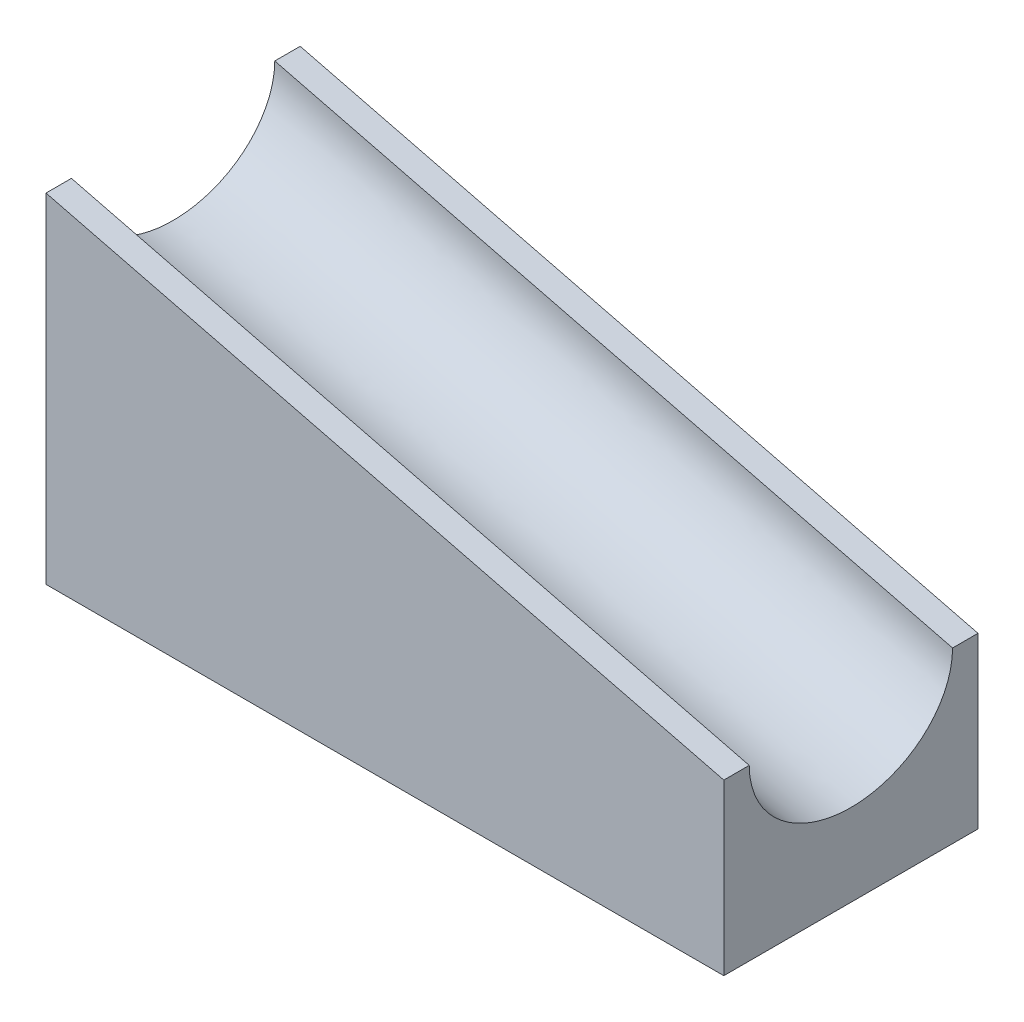
ISO-10303-21;
HEADER;
FILE_DESCRIPTION(('STEP AP214'),'2;1');
FILE_NAME('part.step','',(''),(''),'','','');
FILE_SCHEMA(('AUTOMOTIVE_DESIGN { 1 0 10303 214 1 1 1 1 }'));
ENDSEC;
DATA;
#1=APPLICATION_CONTEXT('core data for automotive mechanical design processes');
#2=APPLICATION_PROTOCOL_DEFINITION('international standard','automotive_design',2000,#1);
#3=PRODUCT_CONTEXT('',#1,'mechanical');
#4=PRODUCT('Part','Part','',(#3));
#5=PRODUCT_RELATED_PRODUCT_CATEGORY('part','',(#4));
#6=PRODUCT_DEFINITION_FORMATION('','',#4);
#7=PRODUCT_DEFINITION_CONTEXT('part definition',#1,'design');
#8=PRODUCT_DEFINITION('design','',#6,#7);
#9=PRODUCT_DEFINITION_SHAPE('','',#8);
#10=(LENGTH_UNIT() NAMED_UNIT(*) SI_UNIT(.MILLI.,.METRE.));
#11=(NAMED_UNIT(*) PLANE_ANGLE_UNIT() SI_UNIT($,.RADIAN.));
#12=(NAMED_UNIT(*) SI_UNIT($,.STERADIAN.) SOLID_ANGLE_UNIT());
#13=UNCERTAINTY_MEASURE_WITH_UNIT(LENGTH_MEASURE(1.E-05),#10,'distance_accuracy_value','');
#14=(GEOMETRIC_REPRESENTATION_CONTEXT(3) GLOBAL_UNCERTAINTY_ASSIGNED_CONTEXT((#13)) GLOBAL_UNIT_ASSIGNED_CONTEXT((#10,
#11,#12)) REPRESENTATION_CONTEXT('',''));
#15=CARTESIAN_POINT('',(0.,0.,0.));
#16=DIRECTION('',(0.,0.,1.));
#17=DIRECTION('',(1.,0.,0.));
#18=AXIS2_PLACEMENT_3D('',#15,#16,#17);
#19=CARTESIAN_POINT('',(25.4,0.,19.05));
#20=DIRECTION('',(-0.242535625036333,-0.970142500145332,0.));
#21=DIRECTION('',(0.970142500145332,-0.242535625036333,0.));
#22=AXIS2_PLACEMENT_3D('',#19,#20,#21);
#23=PLANE('',#22);
#24=DIRECTION('',(0.,0.,-1.));
#25=VECTOR('',#24,1.);
#26=CARTESIAN_POINT('',(25.4,0.,19.05));
#27=LINE('',#26,#25);
#28=CARTESIAN_POINT('',(25.4,0.,19.05));
#29=VERTEX_POINT('',#28);
#30=CARTESIAN_POINT('',(25.4,0.,17.145));
#31=VERTEX_POINT('',#30);
#32=EDGE_CURVE('E132',#29,#31,#27,.T.);
#33=ORIENTED_EDGE('',*,*,#32,.T.);
#34=DIRECTION('',(-0.970142500145332,0.242535625036333,0.));
#35=VECTOR('',#34,1.);
#36=CARTESIAN_POINT('',(28.3882352941176,-0.747058823529411,17.145));
#37=LINE('',#36,#35);
#38=CARTESIAN_POINT('',(-25.4,12.7,17.145));
#39=VERTEX_POINT('',#38);
#40=EDGE_CURVE('E61',#31,#39,#37,.T.);
#41=ORIENTED_EDGE('',*,*,#40,.T.);
#42=DIRECTION('',(0.,0.,-1.));
#43=VECTOR('',#42,1.);
#44=CARTESIAN_POINT('',(-25.4,12.7,19.05));
#45=LINE('',#44,#43);
#46=CARTESIAN_POINT('',(-25.4,12.7,19.05));
#47=VERTEX_POINT('',#46);
#48=EDGE_CURVE('E54',#47,#39,#45,.T.);
#49=ORIENTED_EDGE('',*,*,#48,.F.);
#50=DIRECTION('',(-0.970142500145332,0.242535625036333,0.));
#51=VECTOR('',#50,1.);
#52=CARTESIAN_POINT('',(25.4,0.,19.05));
#53=LINE('',#52,#51);
#54=EDGE_CURVE('E139',#29,#47,#53,.T.);
#55=ORIENTED_EDGE('',*,*,#54,.F.);
#56=EDGE_LOOP('',(#33,#41,#49,#55));
#57=FACE_BOUND('',#56,.T.);
#58=ADVANCED_FACE('F39',(#57),#23,.F.);
#59=CARTESIAN_POINT('',(-25.4,12.7,1.905));
#60=VERTEX_POINT('',#59);
#61=CARTESIAN_POINT('',(-25.4,12.7,0.));
#62=VERTEX_POINT('',#61);
#63=EDGE_CURVE('E114',#60,#62,#45,.T.);
#64=ORIENTED_EDGE('',*,*,#63,.F.);
#65=DIRECTION('',(-0.970142500145332,0.242535625036333,0.));
#66=VECTOR('',#65,1.);
#67=CARTESIAN_POINT('',(28.3882352941176,-0.747058823529411,1.905));
#68=LINE('',#67,#66);
#69=CARTESIAN_POINT('',(25.4,0.,1.905));
#70=VERTEX_POINT('',#69);
#71=EDGE_CURVE('E106',#60,#70,#68,.F.);
#72=ORIENTED_EDGE('',*,*,#71,.T.);
#73=CARTESIAN_POINT('',(25.4,0.,0.));
#74=VERTEX_POINT('',#73);
#75=EDGE_CURVE('E91',#70,#74,#27,.T.);
#76=ORIENTED_EDGE('',*,*,#75,.T.);
#77=DIRECTION('',(-0.970142500145332,0.242535625036333,0.));
#78=VECTOR('',#77,1.);
#79=CARTESIAN_POINT('',(25.4,0.,0.));
#80=LINE('',#79,#78);
#81=EDGE_CURVE('E118',#74,#62,#80,.T.);
#82=ORIENTED_EDGE('',*,*,#81,.T.);
#83=EDGE_LOOP('',(#64,#72,#76,#82));
#84=FACE_BOUND('',#83,.T.);
#85=ADVANCED_FACE('F41',(#84),#23,.F.);
#86=CARTESIAN_POINT('',(-25.4,12.7,19.05));
#87=DIRECTION('',(1.,0.,0.));
#88=DIRECTION('',(0.,0.,-1.));
#89=AXIS2_PLACEMENT_3D('',#86,#87,#88);
#90=PLANE('',#89);
#91=ORIENTED_EDGE('',*,*,#48,.T.);
#92=CARTESIAN_POINT('',(-25.4,12.7,17.145));
#93=CARTESIAN_POINT('',(-25.4,12.5397558941542,17.1450310668123));
#94=CARTESIAN_POINT('',(-25.4,12.3795233099248,17.138150695475));
#95=CARTESIAN_POINT('',(-25.4,12.0600913189145,17.1107820879656));
#96=CARTESIAN_POINT('',(-25.4,11.9008928586387,17.0902827866004));
#97=CARTESIAN_POINT('',(-25.4,11.5832015192504,17.0356163179047));
#98=CARTESIAN_POINT('',(-25.4,11.4247321530515,17.001312701185));
#99=CARTESIAN_POINT('',(-25.4,11.1111921247261,16.9194713256208));
#100=CARTESIAN_POINT('',(-25.4,10.956122760515,16.8719286046039));
#101=CARTESIAN_POINT('',(-25.4,10.6502845625391,16.7641296116948));
#102=CARTESIAN_POINT('',(-25.4,10.499520630885,16.7038594561818));
#103=CARTESIAN_POINT('',(-25.4,10.2033141441203,16.5713033345608));
#104=CARTESIAN_POINT('',(-25.3999999999999,10.0578735947049,16.4990128952797));
#105=CARTESIAN_POINT('',(-25.3999999999999,9.77072161071703,16.3418729745761));
#106=CARTESIAN_POINT('',(-25.4,9.62911591783702,16.2568305155411));
#107=CARTESIAN_POINT('',(-25.4,9.3529029832159,16.0759546924849));
#108=CARTESIAN_POINT('',(-25.4,9.21829864747412,15.9801168991546));
#109=CARTESIAN_POINT('',(-25.4,8.95687769655583,15.7786931762532));
#110=CARTESIAN_POINT('',(-25.4,8.83005137114391,15.6731198309599));
#111=CARTESIAN_POINT('',(-25.4,8.58443611051542,15.4529991148128));
#112=CARTESIAN_POINT('',(-25.4,8.46564805702274,15.3384507624482));
#113=CARTESIAN_POINT('',(-25.4,8.22490780585166,15.0892852206847));
#114=CARTESIAN_POINT('',(-25.4,8.10384338942295,14.9538089428059));
#115=CARTESIAN_POINT('',(-25.4,7.87227384504712,14.6742115282824));
#116=CARTESIAN_POINT('',(-25.4,7.76176689050555,14.5300918941129));
#117=CARTESIAN_POINT('',(-25.4,7.44452772263791,14.0836313443756));
#118=CARTESIAN_POINT('',(-25.4,7.25421750068056,13.7694270434655));
#119=CARTESIAN_POINT('',(-25.4,6.91853599935933,13.1177494117741));
#120=CARTESIAN_POINT('',(-25.3999999999998,6.77320303528535,12.7802565395319));
#121=CARTESIAN_POINT('',(-25.3999999999999,6.57700883386407,12.2274846313262));
#122=CARTESIAN_POINT('',(-25.4,6.51160039167155,12.0172387971646));
#123=CARTESIAN_POINT('',(-25.4,6.39720511092881,11.5924914837491));
#124=CARTESIAN_POINT('',(-25.4,6.34820465212695,11.3779936915068));
#125=CARTESIAN_POINT('',(-25.4,6.26656421164684,10.9458923321024));
#126=CARTESIAN_POINT('',(-25.4,6.23392547722766,10.7282885294681));
#127=CARTESIAN_POINT('',(-25.4,6.18499433644996,10.2912542378552));
#128=CARTESIAN_POINT('',(-25.4,6.16870534519203,10.0718233768914));
#129=CARTESIAN_POINT('',(-25.4,6.14440184634698,9.41273443655388));
#130=CARTESIAN_POINT('',(-25.4,6.16088057137696,8.97190446799246));
#131=CARTESIAN_POINT('',(-25.4,6.25924995749359,8.09776792821491));
#132=CARTESIAN_POINT('',(-25.4000000000001,6.34114571764149,7.6644619461611));
#133=CARTESIAN_POINT('',(-25.3999999999998,6.57056749285265,6.81502614082543));
#134=CARTESIAN_POINT('',(-25.3999999999993,6.71810785026342,6.39890009282207));
#135=CARTESIAN_POINT('',(-25.3999999999996,6.98730267610402,5.79874439427081));
#136=CARTESIAN_POINT('',(-25.3999999999999,7.08451239266582,5.60346162335834));
#137=CARTESIAN_POINT('',(-25.4000000000001,7.29477113502594,5.22165308347563));
#138=CARTESIAN_POINT('',(-25.4,7.40781275011916,5.03512327158607));
#139=CARTESIAN_POINT('',(-25.4,7.64076939659653,4.68558961360168));
#140=CARTESIAN_POINT('',(-25.4,7.75959680672251,4.52185985176995));
#141=CARTESIAN_POINT('',(-25.4,8.01034604634945,4.20484933283172));
#142=CARTESIAN_POINT('',(-25.4,8.14226133195075,4.05156341785747));
#143=CARTESIAN_POINT('',(-25.4,8.40888349921536,3.7674401572589));
#144=CARTESIAN_POINT('',(-25.4,8.54271499624138,3.63578134128219));
#145=CARTESIAN_POINT('',(-25.4,8.82077011454368,3.38404181906095));
#146=CARTESIAN_POINT('',(-25.4,8.9649887033523,3.26395557105801));
#147=CARTESIAN_POINT('',(-25.4,9.25340180734697,3.04407466448976));
#148=CARTESIAN_POINT('',(-25.4,9.39697500495921,2.94346510878717));
#149=CARTESIAN_POINT('',(-25.4,9.69191523738055,2.75452788313779));
#150=CARTESIAN_POINT('',(-25.4,9.84327862591422,2.66619453755716));
#151=CARTESIAN_POINT('',(-25.4,10.1446464819367,2.50719214591523));
#152=CARTESIAN_POINT('',(-25.4,10.2942838387373,2.43582728704804));
#153=CARTESIAN_POINT('',(-25.4,10.5989121087761,2.30578922780137));
#154=CARTESIAN_POINT('',(-25.3999999999999,10.7539005579524,2.24711027389726));
#155=CARTESIAN_POINT('',(-25.3999999999999,11.0532580512534,2.14809176087484));
#156=CARTESIAN_POINT('',(-25.4,11.1972254120784,2.10653509277634));
#157=CARTESIAN_POINT('',(-25.4,11.4879578327933,2.03478385838654));
#158=CARTESIAN_POINT('',(-25.4,11.6347226422039,2.00458827981524));
#159=CARTESIAN_POINT('',(-25.4,11.9339899739671,1.9552663984623));
#160=CARTESIAN_POINT('',(-25.4,12.0865429284686,1.9364451491315));
#161=CARTESIAN_POINT('',(-25.4,12.3927277922997,1.91129647307304));
#162=CARTESIAN_POINT('',(-25.4,12.5463600623974,1.90497344493143));
#163=CARTESIAN_POINT('',(-25.4,12.7,1.905));
#164=B_SPLINE_CURVE_WITH_KNOTS('',3,(#92,#93,#94,#95,#96,#97,#98,#99,#100,#101,#102,#103,#104,
#105,#106,#107,#108,#109,#110,#111,#112,#113,#114,#115,#116,#117,#118,#119,#120,#121,#122,#123,
#124,#125,#126,#127,#128,#129,#130,#131,#132,#133,#134,#135,#136,#137,#138,#139,#140,#141,#142,
#143,#144,#145,#146,#147,#148,#149,#150,#151,#152,#153,#154,#155,#156,#157,#158,#159,#160,#161,
#162,#163),.UNSPECIFIED.,.F.,.F.,(4,2,2,2,2,2,2,2,2,2,2,2,2,2,2,2,2,2,2,2,2,2,2,2,2,2,2,2,2,2,2,
2,2,2,2,4),(0.,0.480566390796927,0.961523713461153,1.44735667162258,1.93337197136913,
2.41992020128128,2.90664989990979,3.40167163583662,3.89689722336805,4.39149141770862,
4.88613977679714,5.43064308130505,5.97505200756475,7.07306954719025,8.17201990901444,
8.83198669188204,9.49140427093902,10.1508721099516,10.8104776685967,12.1285538720992,
13.4467328257066,14.7651999229293,15.4190133390785,16.0725217302407,16.6787878833522,
17.2847524183422,17.8473512849042,18.409679386736,18.9350512105165,19.4601793264402,
19.9569814867387,20.4535578540868,20.9026509929041,21.3517041077683,21.8123202707442,
22.2730985127322),.UNSPECIFIED.);
#165=EDGE_CURVE('E109',#39,#60,#164,.T.);
#166=ORIENTED_EDGE('',*,*,#165,.T.);
#167=ORIENTED_EDGE('',*,*,#63,.T.);
#168=DIRECTION('',(0.,-1.,0.));
#169=VECTOR('',#168,1.);
#170=CARTESIAN_POINT('',(-25.4,12.7,0.));
#171=LINE('',#170,#169);
#172=CARTESIAN_POINT('',(-25.4,-12.7,0.));
#173=VERTEX_POINT('',#172);
#174=EDGE_CURVE('E143',#62,#173,#171,.T.);
#175=ORIENTED_EDGE('',*,*,#174,.T.);
#176=DIRECTION('',(0.,0.,-1.));
#177=VECTOR('',#176,1.);
#178=CARTESIAN_POINT('',(-25.4,-12.7,19.05));
#179=LINE('',#178,#177);
#180=CARTESIAN_POINT('',(-25.4,-12.7,19.05));
#181=VERTEX_POINT('',#180);
#182=EDGE_CURVE('E122',#181,#173,#179,.T.);
#183=ORIENTED_EDGE('',*,*,#182,.F.);
#184=DIRECTION('',(0.,-1.,0.));
#185=VECTOR('',#184,1.);
#186=CARTESIAN_POINT('',(-25.4,12.7,19.05));
#187=LINE('',#186,#185);
#188=EDGE_CURVE('E99',#47,#181,#187,.T.);
#189=ORIENTED_EDGE('',*,*,#188,.F.);
#190=EDGE_LOOP('',(#91,#166,#167,#175,#183,#189));
#191=FACE_BOUND('',#190,.T.);
#192=ADVANCED_FACE('F113',(#191),#90,.F.);
#193=CARTESIAN_POINT('',(-25.4,-12.7,19.05));
#194=DIRECTION('',(0.,1.,0.));
#195=DIRECTION('',(-1.,0.,0.));
#196=AXIS2_PLACEMENT_3D('',#193,#194,#195);
#197=PLANE('',#196);
#198=DIRECTION('',(1.,0.,0.));
#199=VECTOR('',#198,1.);
#200=CARTESIAN_POINT('',(-25.4,-12.7,0.));
#201=LINE('',#200,#199);
#202=CARTESIAN_POINT('',(25.4,-12.7,0.));
#203=VERTEX_POINT('',#202);
#204=EDGE_CURVE('E140',#173,#203,#201,.T.);
#205=ORIENTED_EDGE('',*,*,#204,.T.);
#206=DIRECTION('',(0.,0.,-1.));
#207=VECTOR('',#206,1.);
#208=CARTESIAN_POINT('',(25.4,-12.7,19.05));
#209=LINE('',#208,#207);
#210=CARTESIAN_POINT('',(25.4,-12.7,19.05));
#211=VERTEX_POINT('',#210);
#212=EDGE_CURVE('E126',#211,#203,#209,.T.);
#213=ORIENTED_EDGE('',*,*,#212,.F.);
#214=DIRECTION('',(1.,0.,0.));
#215=VECTOR('',#214,1.);
#216=CARTESIAN_POINT('',(-25.4,-12.7,19.05));
#217=LINE('',#216,#215);
#218=EDGE_CURVE('E150',#181,#211,#217,.T.);
#219=ORIENTED_EDGE('',*,*,#218,.F.);
#220=ORIENTED_EDGE('',*,*,#182,.T.);
#221=EDGE_LOOP('',(#205,#213,#219,#220));
#222=FACE_BOUND('',#221,.T.);
#223=ADVANCED_FACE('F178',(#222),#197,.F.);
#224=CARTESIAN_POINT('',(25.4,-12.7,19.05));
#225=DIRECTION('',(-1.,0.,0.));
#226=DIRECTION('',(0.,0.,1.));
#227=AXIS2_PLACEMENT_3D('',#224,#225,#226);
#228=PLANE('',#227);
#229=ORIENTED_EDGE('',*,*,#75,.F.);
#230=CARTESIAN_POINT('',(25.4,0.,1.905));
#231=CARTESIAN_POINT('',(25.4,-0.160244105845777,1.9049689331877));
#232=CARTESIAN_POINT('',(25.4,-0.320476690075222,1.911849304525));
#233=CARTESIAN_POINT('',(25.4,-0.639908681085497,1.93921791203438));
#234=CARTESIAN_POINT('',(25.4,-0.799107141361333,1.95971721339962));
#235=CARTESIAN_POINT('',(25.4,-1.11679848074955,2.01438368209529));
#236=CARTESIAN_POINT('',(25.4,-1.27526784694848,2.048687298815));
#237=CARTESIAN_POINT('',(25.4,-1.58880787527391,2.13052867437923));
#238=CARTESIAN_POINT('',(25.4,-1.74387723948497,2.17807139539607));
#239=CARTESIAN_POINT('',(25.4,-2.0497154374609,2.28587038830521));
#240=CARTESIAN_POINT('',(25.4,-2.20047936911495,2.34614054381818));
#241=CARTESIAN_POINT('',(25.4,-2.49668585587969,2.47869666543916));
#242=CARTESIAN_POINT('',(25.4000000000002,-2.64212640529513,2.55098710472032));
#243=CARTESIAN_POINT('',(25.4000000000002,-2.92927838928296,2.70812702542388));
#244=CARTESIAN_POINT('',(25.4,-3.07088408216296,2.79316948445889));
#245=CARTESIAN_POINT('',(25.4,-3.34709701678408,2.9740453075151));
#246=CARTESIAN_POINT('',(25.4,-3.48170135252587,3.06988310084535));
#247=CARTESIAN_POINT('',(25.4,-3.74312230344416,3.27130682374682));
#248=CARTESIAN_POINT('',(25.4,-3.86994862885608,3.37688016904012));
#249=CARTESIAN_POINT('',(25.4,-4.11556388948457,3.59700088518717));
#250=CARTESIAN_POINT('',(25.4,-4.23435194297724,3.71154923755183));
#251=CARTESIAN_POINT('',(25.4,-4.47509219414832,3.9607147793153));
#252=CARTESIAN_POINT('',(25.4,-4.59615661057704,4.09619105719405));
#253=CARTESIAN_POINT('',(25.4,-4.82772615495286,4.37578847171762));
#254=CARTESIAN_POINT('',(25.4,-4.93823310949443,4.51990810588707));
#255=CARTESIAN_POINT('',(25.4,-5.25547227736207,4.9663686556244));
#256=CARTESIAN_POINT('',(25.4,-5.44578249931943,5.28057295653449));
#257=CARTESIAN_POINT('',(25.4,-5.78146400064065,5.93225058822586));
#258=CARTESIAN_POINT('',(25.4000000000002,-5.92679696471463,6.2697434604681));
#259=CARTESIAN_POINT('',(25.4000000000001,-6.12299116613592,6.82251536867379));
#260=CARTESIAN_POINT('',(25.4,-6.18839960832844,7.03276120283541));
#261=CARTESIAN_POINT('',(25.4,-6.30279488907118,7.45750851625091));
#262=CARTESIAN_POINT('',(25.4,-6.35179534787304,7.67200630849314));
#263=CARTESIAN_POINT('',(25.4,-6.43343578835316,8.10410766789755));
#264=CARTESIAN_POINT('',(25.4,-6.46607452277234,8.32171147053181));
#265=CARTESIAN_POINT('',(25.4,-6.51500566355004,8.7587457621448));
#266=CARTESIAN_POINT('',(25.4,-6.53129465480797,8.97817662310855));
#267=CARTESIAN_POINT('',(25.4,-6.55559815365302,9.63726556344607));
#268=CARTESIAN_POINT('',(25.4,-6.53911942862304,10.0780955320075));
#269=CARTESIAN_POINT('',(25.4,-6.44075004250642,10.952232071785));
#270=CARTESIAN_POINT('',(25.3999999999999,-6.35885428235852,11.3855380538389));
#271=CARTESIAN_POINT('',(25.4000000000002,-6.12943250714736,12.2349738591745));
#272=CARTESIAN_POINT('',(25.4000000000007,-5.98189214973659,12.6510999071779));
#273=CARTESIAN_POINT('',(25.4000000000004,-5.712697323896,13.2512556057291));
#274=CARTESIAN_POINT('',(25.4000000000001,-5.6154876073342,13.4465383766416));
#275=CARTESIAN_POINT('',(25.3999999999999,-5.40522886497408,13.8283469165243));
#276=CARTESIAN_POINT('',(25.4,-5.29218724988086,14.0148767284139));
#277=CARTESIAN_POINT('',(25.4,-5.0592306034035,14.3644103863983));
#278=CARTESIAN_POINT('',(25.4,-4.94040319327751,14.52814014823));
#279=CARTESIAN_POINT('',(25.4,-4.68965395365058,14.8451506671682));
#280=CARTESIAN_POINT('',(25.4,-4.55773866804928,14.9984365821425));
#281=CARTESIAN_POINT('',(25.4,-4.29111650078467,15.2825598427411));
#282=CARTESIAN_POINT('',(25.4,-4.15728500375865,15.4142186587178));
#283=CARTESIAN_POINT('',(25.4,-3.87922988545635,15.665958180939));
#284=CARTESIAN_POINT('',(25.4,-3.73501129664773,15.786044428942));
#285=CARTESIAN_POINT('',(25.4,-3.44659819265306,16.0059253355102));
#286=CARTESIAN_POINT('',(25.4,-3.30302499504082,16.1065348912128));
#287=CARTESIAN_POINT('',(25.4,-3.00808476261948,16.2954721168622));
#288=CARTESIAN_POINT('',(25.4,-2.85672137408581,16.3838054624428));
#289=CARTESIAN_POINT('',(25.4,-2.55535351806331,16.5428078540847));
#290=CARTESIAN_POINT('',(25.4,-2.40571616126275,16.6141727129519));
#291=CARTESIAN_POINT('',(25.4,-2.10108789122396,16.7442107721986));
#292=CARTESIAN_POINT('',(25.4000000000001,-1.94609944204763,16.8028897261027));
#293=CARTESIAN_POINT('',(25.4000000000001,-1.64674194874662,16.9019082391251));
#294=CARTESIAN_POINT('',(25.4,-1.50277458792158,16.9434649072236));
#295=CARTESIAN_POINT('',(25.4,-1.21204216720669,17.0152161416135));
#296=CARTESIAN_POINT('',(25.4,-1.06527735779608,17.0454117201848));
#297=CARTESIAN_POINT('',(25.4,-0.766010026032922,17.0947336015377));
#298=CARTESIAN_POINT('',(25.4,-0.613457071531382,17.1135548508685));
#299=CARTESIAN_POINT('',(25.4,-0.30727220770028,17.138703526927));
#300=CARTESIAN_POINT('',(25.4,-0.153639937602622,17.1450265550686));
#301=CARTESIAN_POINT('',(25.4,0.,17.145));
#302=B_SPLINE_CURVE_WITH_KNOTS('',3,(#230,#231,#232,#233,#234,#235,#236,#237,#238,#239,#240,
#241,#242,#243,#244,#245,#246,#247,#248,#249,#250,#251,#252,#253,#254,#255,#256,#257,#258,#259,
#260,#261,#262,#263,#264,#265,#266,#267,#268,#269,#270,#271,#272,#273,#274,#275,#276,#277,#278,
#279,#280,#281,#282,#283,#284,#285,#286,#287,#288,#289,#290,#291,#292,#293,#294,#295,#296,#297,
#298,#299,#300,#301),.UNSPECIFIED.,.F.,.F.,(4,2,2,2,2,2,2,2,2,2,2,2,2,2,2,2,2,2,2,2,2,2,2,2,2,2,
2,2,2,2,2,2,2,2,2,4),(0.,0.480566390796925,0.96152371346115,1.44735667162258,1.93337197136913,
2.41992020128127,2.90664989990978,3.40167163583661,3.89689722336804,4.39149141770862,
4.88613977679713,5.43064308130504,5.97505200756473,7.07306954719023,8.17201990901442,
8.83198669188202,9.49140427093899,10.1508721099515,10.8104776685967,12.1285538720991,
13.4467328257066,14.7651999229293,15.4190133390785,16.0725217302406,16.6787878833521,
17.2847524183422,17.8473512849042,18.409679386736,18.9350512105165,19.4601793264402,
19.9569814867387,20.4535578540868,20.9026509929041,21.3517041077683,21.8123202707442,
22.2730985127323),.UNSPECIFIED.);
#303=EDGE_CURVE('E11',#70,#31,#302,.T.);
#304=ORIENTED_EDGE('',*,*,#303,.T.);
#305=ORIENTED_EDGE('',*,*,#32,.F.);
#306=DIRECTION('',(0.,1.,0.));
#307=VECTOR('',#306,1.);
#308=CARTESIAN_POINT('',(25.4,-12.7,19.05));
#309=LINE('',#308,#307);
#310=EDGE_CURVE('E69',#211,#29,#309,.T.);
#311=ORIENTED_EDGE('',*,*,#310,.F.);
#312=ORIENTED_EDGE('',*,*,#212,.T.);
#313=DIRECTION('',(0.,1.,0.));
#314=VECTOR('',#313,1.);
#315=CARTESIAN_POINT('',(25.4,-12.7,0.));
#316=LINE('',#315,#314);
#317=EDGE_CURVE('E136',#203,#74,#316,.T.);
#318=ORIENTED_EDGE('',*,*,#317,.T.);
#319=EDGE_LOOP('',(#229,#304,#305,#311,#312,#318));
#320=FACE_BOUND('',#319,.T.);
#321=ADVANCED_FACE('F173',(#320),#228,.F.);
#322=CARTESIAN_POINT('',(0.,0.,19.05));
#323=DIRECTION('',(0.,0.,1.));
#324=DIRECTION('',(1.,0.,0.));
#325=AXIS2_PLACEMENT_3D('',#322,#323,#324);
#326=PLANE('',#325);
#327=ORIENTED_EDGE('',*,*,#54,.T.);
#328=ORIENTED_EDGE('',*,*,#188,.T.);
#329=ORIENTED_EDGE('',*,*,#218,.T.);
#330=ORIENTED_EDGE('',*,*,#310,.T.);
#331=EDGE_LOOP('',(#327,#328,#329,#330));
#332=FACE_BOUND('',#331,.T.);
#333=ADVANCED_FACE('F168',(#332),#326,.T.);
#334=CARTESIAN_POINT('',(0.,0.,0.));
#335=DIRECTION('',(0.,0.,1.));
#336=DIRECTION('',(1.,0.,0.));
#337=AXIS2_PLACEMENT_3D('',#334,#335,#336);
#338=PLANE('',#337);
#339=ORIENTED_EDGE('',*,*,#81,.F.);
#340=ORIENTED_EDGE('',*,*,#317,.F.);
#341=ORIENTED_EDGE('',*,*,#204,.F.);
#342=ORIENTED_EDGE('',*,*,#174,.F.);
#343=EDGE_LOOP('',(#339,#340,#341,#342));
#344=FACE_BOUND('',#343,.T.);
#345=ADVANCED_FACE('F167',(#344),#338,.F.);
#346=CARTESIAN_POINT('',(28.3882352941176,-0.747058823529411,9.525));
#347=DIRECTION('',(-0.970142500145332,0.242535625036333,0.));
#348=DIRECTION('',(0.,0.,-1.));
#349=AXIS2_PLACEMENT_3D('',#346,#347,#348);
#350=ELLIPSE('',#349,7.62,6.35);
#351=DIRECTION('',(-0.970142500145332,0.242535625036333,0.));
#352=VECTOR('',#351,1.);
#353=SURFACE_OF_LINEAR_EXTRUSION('',#350,#352);
#354=ORIENTED_EDGE('',*,*,#40,.F.);
#355=ORIENTED_EDGE('',*,*,#303,.F.);
#356=ORIENTED_EDGE('',*,*,#71,.F.);
#357=ORIENTED_EDGE('',*,*,#165,.F.);
#358=EDGE_LOOP('',(#354,#355,#356,#357));
#359=FACE_BOUND('',#358,.T.);
#360=ADVANCED_FACE('F108',(#359),#353,.F.);
#361=CLOSED_SHELL('',(#58,#85,#192,#223,#321,#333,#345,#360));
#362=MANIFOLD_SOLID_BREP('B2',#361);
#363=ADVANCED_BREP_SHAPE_REPRESENTATION('',(#18,#362),#14);
#364=SHAPE_DEFINITION_REPRESENTATION(#9,#363);
ENDSEC;
END-ISO-10303-21;
